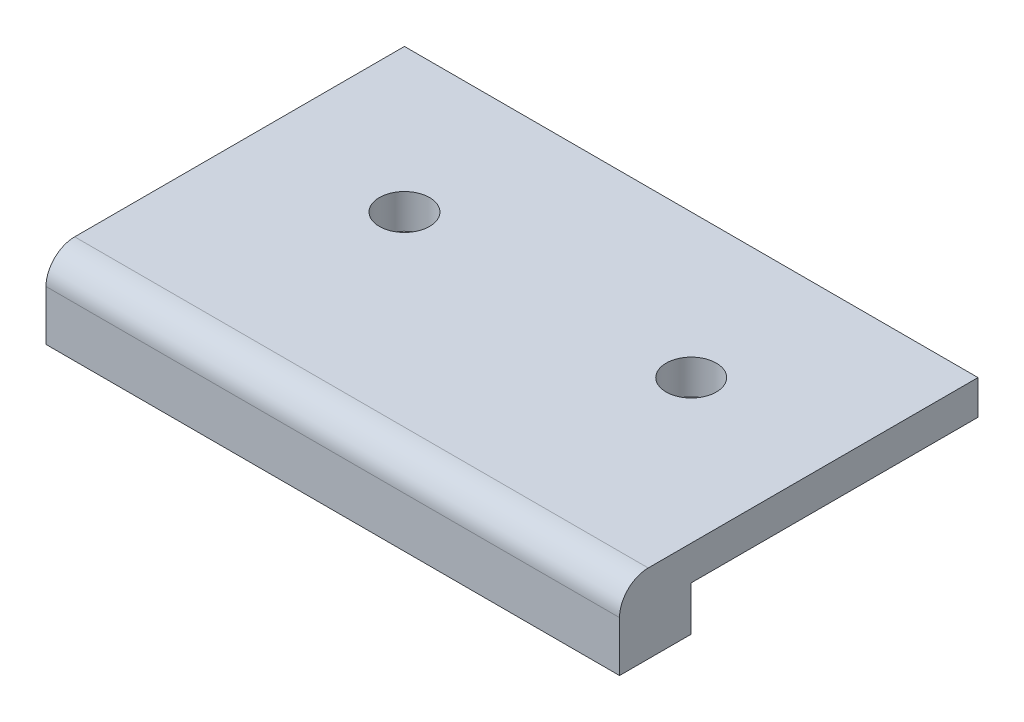
ISO-10303-21;
HEADER;
FILE_DESCRIPTION(('STEP AP214'),'2;1');
FILE_NAME('part.step','',(''),(''),'','','');
FILE_SCHEMA(('AUTOMOTIVE_DESIGN { 1 0 10303 214 1 1 1 1 }'));
ENDSEC;
DATA;
#1=APPLICATION_CONTEXT('core data for automotive mechanical design processes');
#2=APPLICATION_PROTOCOL_DEFINITION('international standard','automotive_design',2000,#1);
#3=PRODUCT_CONTEXT('',#1,'mechanical');
#4=PRODUCT('Part','Part','',(#3));
#5=PRODUCT_RELATED_PRODUCT_CATEGORY('part','',(#4));
#6=PRODUCT_DEFINITION_FORMATION('','',#4);
#7=PRODUCT_DEFINITION_CONTEXT('part definition',#1,'design');
#8=PRODUCT_DEFINITION('design','',#6,#7);
#9=PRODUCT_DEFINITION_SHAPE('','',#8);
#10=(LENGTH_UNIT() NAMED_UNIT(*) SI_UNIT(.MILLI.,.METRE.));
#11=(NAMED_UNIT(*) PLANE_ANGLE_UNIT() SI_UNIT($,.RADIAN.));
#12=(NAMED_UNIT(*) SI_UNIT($,.STERADIAN.) SOLID_ANGLE_UNIT());
#13=UNCERTAINTY_MEASURE_WITH_UNIT(LENGTH_MEASURE(1.E-05),#10,'distance_accuracy_value','');
#14=(GEOMETRIC_REPRESENTATION_CONTEXT(3) GLOBAL_UNCERTAINTY_ASSIGNED_CONTEXT((#13)) GLOBAL_UNIT_ASSIGNED_CONTEXT((#10,
#11,#12)) REPRESENTATION_CONTEXT('',''));
#15=CARTESIAN_POINT('',(0.,0.,0.));
#16=DIRECTION('',(0.,0.,1.));
#17=DIRECTION('',(1.,0.,0.));
#18=AXIS2_PLACEMENT_3D('',#15,#16,#17);
#19=CARTESIAN_POINT('',(0.,2.4,0.));
#20=DIRECTION('',(0.,-1.,0.));
#21=DIRECTION('',(0.,0.,-1.));
#22=AXIS2_PLACEMENT_3D('',#19,#20,#21);
#23=PLANE('',#22);
#24=DIRECTION('',(0.,0.,1.));
#25=VECTOR('',#24,1.);
#26=CARTESIAN_POINT('',(0.,2.4,0.));
#27=LINE('',#26,#25);
#28=CARTESIAN_POINT('',(0.,2.4,-20.));
#29=VERTEX_POINT('',#28);
#30=CARTESIAN_POINT('',(0.,2.4,3.));
#31=VERTEX_POINT('',#30);
#32=EDGE_CURVE('E134',#29,#31,#27,.T.);
#33=ORIENTED_EDGE('',*,*,#32,.T.);
#34=DIRECTION('',(1.,0.,0.));
#35=VECTOR('',#34,1.);
#36=CARTESIAN_POINT('',(40.,2.4,3.));
#37=LINE('',#36,#35);
#38=CARTESIAN_POINT('',(40.,2.4,3.));
#39=VERTEX_POINT('',#38);
#40=EDGE_CURVE('E154',#31,#39,#37,.T.);
#41=ORIENTED_EDGE('',*,*,#40,.T.);
#42=DIRECTION('',(0.,0.,-1.));
#43=VECTOR('',#42,1.);
#44=CARTESIAN_POINT('',(40.,2.4,0.));
#45=LINE('',#44,#43);
#46=CARTESIAN_POINT('',(40.,2.4,-20.));
#47=VERTEX_POINT('',#46);
#48=EDGE_CURVE('E137',#39,#47,#45,.T.);
#49=ORIENTED_EDGE('',*,*,#48,.T.);
#50=DIRECTION('',(-1.,0.,0.));
#51=VECTOR('',#50,1.);
#52=CARTESIAN_POINT('',(0.,2.4,-20.));
#53=LINE('',#52,#51);
#54=EDGE_CURVE('E140',#47,#29,#53,.T.);
#55=ORIENTED_EDGE('',*,*,#54,.T.);
#56=EDGE_LOOP('',(#33,#41,#49,#55));
#57=FACE_BOUND('',#56,.T.);
#58=CARTESIAN_POINT('',(10.,2.4,-10.));
#59=DIRECTION('',(0.,1.,0.));
#60=DIRECTION('',(0.,0.,1.));
#61=AXIS2_PLACEMENT_3D('',#58,#59,#60);
#62=CIRCLE('',#61,1.75);
#63=CARTESIAN_POINT('',(10.,2.4,-8.25));
#64=VERTEX_POINT('',#63);
#65=EDGE_CURVE('E128',#64,#64,#62,.T.);
#66=ORIENTED_EDGE('',*,*,#65,.F.);
#67=EDGE_LOOP('',(#66));
#68=FACE_BOUND('',#67,.T.);
#69=CARTESIAN_POINT('',(30.,2.4,-10.));
#70=DIRECTION('',(0.,1.,0.));
#71=DIRECTION('',(0.,0.,-1.));
#72=AXIS2_PLACEMENT_3D('',#69,#70,#71);
#73=CIRCLE('',#72,1.75);
#74=CARTESIAN_POINT('',(30.,2.4,-11.75));
#75=VERTEX_POINT('',#74);
#76=EDGE_CURVE('E122',#75,#75,#73,.T.);
#77=ORIENTED_EDGE('',*,*,#76,.F.);
#78=EDGE_LOOP('',(#77));
#79=FACE_BOUND('',#78,.T.);
#80=ADVANCED_FACE('F33',(#57,#68,#79),#23,.F.);
#81=CARTESIAN_POINT('',(0.,0.,0.));
#82=DIRECTION('',(0.,-1.,0.));
#83=DIRECTION('',(0.,0.,-1.));
#84=AXIS2_PLACEMENT_3D('',#81,#82,#83);
#85=PLANE('',#84);
#86=CARTESIAN_POINT('',(10.,0.,-10.));
#87=DIRECTION('',(0.,1.,0.));
#88=DIRECTION('',(0.,0.,1.));
#89=AXIS2_PLACEMENT_3D('',#86,#87,#88);
#90=CIRCLE('',#89,1.75);
#91=CARTESIAN_POINT('',(10.,0.,-8.25));
#92=VERTEX_POINT('',#91);
#93=EDGE_CURVE('E125',#92,#92,#90,.T.);
#94=ORIENTED_EDGE('',*,*,#93,.T.);
#95=EDGE_LOOP('',(#94));
#96=FACE_BOUND('',#95,.T.);
#97=DIRECTION('',(0.,0.,1.));
#98=VECTOR('',#97,1.);
#99=CARTESIAN_POINT('',(0.,0.,0.));
#100=LINE('',#99,#98);
#101=CARTESIAN_POINT('',(0.,0.,-20.));
#102=VERTEX_POINT('',#101);
#103=CARTESIAN_POINT('',(0.,0.,0.));
#104=VERTEX_POINT('',#103);
#105=EDGE_CURVE('E131',#102,#104,#100,.T.);
#106=ORIENTED_EDGE('',*,*,#105,.F.);
#107=DIRECTION('',(-1.,0.,0.));
#108=VECTOR('',#107,1.);
#109=CARTESIAN_POINT('',(0.,0.,-20.));
#110=LINE('',#109,#108);
#111=CARTESIAN_POINT('',(40.,0.,-20.));
#112=VERTEX_POINT('',#111);
#113=EDGE_CURVE('E138',#112,#102,#110,.T.);
#114=ORIENTED_EDGE('',*,*,#113,.F.);
#115=DIRECTION('',(0.,0.,-1.));
#116=VECTOR('',#115,1.);
#117=CARTESIAN_POINT('',(40.,0.,0.));
#118=LINE('',#117,#116);
#119=CARTESIAN_POINT('',(40.,0.,0.));
#120=VERTEX_POINT('',#119);
#121=EDGE_CURVE('E146',#120,#112,#118,.T.);
#122=ORIENTED_EDGE('',*,*,#121,.F.);
#123=DIRECTION('',(1.,0.,0.));
#124=VECTOR('',#123,1.);
#125=CARTESIAN_POINT('',(0.,0.,0.));
#126=LINE('',#125,#124);
#127=EDGE_CURVE('E96',#104,#120,#126,.T.);
#128=ORIENTED_EDGE('',*,*,#127,.F.);
#129=EDGE_LOOP('',(#106,#114,#122,#128));
#130=FACE_BOUND('',#129,.T.);
#131=CARTESIAN_POINT('',(30.,0.,-10.));
#132=DIRECTION('',(0.,1.,0.));
#133=DIRECTION('',(0.,0.,-1.));
#134=AXIS2_PLACEMENT_3D('',#131,#132,#133);
#135=CIRCLE('',#134,1.75);
#136=CARTESIAN_POINT('',(30.,0.,-11.75));
#137=VERTEX_POINT('',#136);
#138=EDGE_CURVE('E118',#137,#137,#135,.T.);
#139=ORIENTED_EDGE('',*,*,#138,.T.);
#140=EDGE_LOOP('',(#139));
#141=FACE_BOUND('',#140,.T.);
#142=ADVANCED_FACE('F178',(#96,#130,#141),#85,.T.);
#143=CARTESIAN_POINT('',(0.,2.4,0.));
#144=DIRECTION('',(1.,0.,0.));
#145=DIRECTION('',(0.,0.,-1.));
#146=AXIS2_PLACEMENT_3D('',#143,#144,#145);
#147=PLANE('',#146);
#148=DIRECTION('',(0.,1.,0.));
#149=VECTOR('',#148,1.);
#150=CARTESIAN_POINT('',(0.,-3.1,5.));
#151=LINE('',#150,#149);
#152=CARTESIAN_POINT('',(0.,-3.1,5.));
#153=VERTEX_POINT('',#152);
#154=CARTESIAN_POINT('',(0.,0.4,5.));
#155=VERTEX_POINT('',#154);
#156=EDGE_CURVE('E119',#153,#155,#151,.T.);
#157=ORIENTED_EDGE('',*,*,#156,.T.);
#158=CARTESIAN_POINT('',(0.,0.4,3.));
#159=DIRECTION('',(1.,0.,0.));
#160=DIRECTION('',(0.,0.,-1.));
#161=AXIS2_PLACEMENT_3D('',#158,#159,#160);
#162=CIRCLE('',#161,2.);
#163=EDGE_CURVE('E11',#155,#31,#162,.F.);
#164=ORIENTED_EDGE('',*,*,#163,.T.);
#165=ORIENTED_EDGE('',*,*,#32,.F.);
#166=DIRECTION('',(0.,-1.,0.));
#167=VECTOR('',#166,1.);
#168=CARTESIAN_POINT('',(0.,2.4,-20.));
#169=LINE('',#168,#167);
#170=EDGE_CURVE('E142',#29,#102,#169,.T.);
#171=ORIENTED_EDGE('',*,*,#170,.T.);
#172=ORIENTED_EDGE('',*,*,#105,.T.);
#173=DIRECTION('',(0.,1.,0.));
#174=VECTOR('',#173,1.);
#175=CARTESIAN_POINT('',(0.,-3.1,0.));
#176=LINE('',#175,#174);
#177=CARTESIAN_POINT('',(0.,-3.1,0.));
#178=VERTEX_POINT('',#177);
#179=EDGE_CURVE('E98',#178,#104,#176,.T.);
#180=ORIENTED_EDGE('',*,*,#179,.F.);
#181=DIRECTION('',(0.,0.,1.));
#182=VECTOR('',#181,1.);
#183=CARTESIAN_POINT('',(0.,-3.1,0.));
#184=LINE('',#183,#182);
#185=EDGE_CURVE('E109',#178,#153,#184,.T.);
#186=ORIENTED_EDGE('',*,*,#185,.T.);
#187=EDGE_LOOP('',(#157,#164,#165,#171,#172,#180,#186));
#188=FACE_BOUND('',#187,.T.);
#189=ADVANCED_FACE('F171',(#188),#147,.F.);
#190=CARTESIAN_POINT('',(40.,2.4,0.));
#191=DIRECTION('',(-1.,0.,0.));
#192=DIRECTION('',(0.,0.,1.));
#193=AXIS2_PLACEMENT_3D('',#190,#191,#192);
#194=PLANE('',#193);
#195=ORIENTED_EDGE('',*,*,#48,.F.);
#196=CARTESIAN_POINT('',(40.,0.4,3.));
#197=DIRECTION('',(-1.,0.,0.));
#198=DIRECTION('',(0.,0.,1.));
#199=AXIS2_PLACEMENT_3D('',#196,#197,#198);
#200=CIRCLE('',#199,2.);
#201=CARTESIAN_POINT('',(40.,0.4,5.));
#202=VERTEX_POINT('',#201);
#203=EDGE_CURVE('E55',#39,#202,#200,.F.);
#204=ORIENTED_EDGE('',*,*,#203,.T.);
#205=DIRECTION('',(0.,1.,0.));
#206=VECTOR('',#205,1.);
#207=CARTESIAN_POINT('',(40.,-3.1,5.));
#208=LINE('',#207,#206);
#209=CARTESIAN_POINT('',(40.,-3.1,5.));
#210=VERTEX_POINT('',#209);
#211=EDGE_CURVE('E112',#210,#202,#208,.T.);
#212=ORIENTED_EDGE('',*,*,#211,.F.);
#213=DIRECTION('',(0.,0.,-1.));
#214=VECTOR('',#213,1.);
#215=CARTESIAN_POINT('',(40.,-3.1,0.));
#216=LINE('',#215,#214);
#217=CARTESIAN_POINT('',(40.,-3.1,0.));
#218=VERTEX_POINT('',#217);
#219=EDGE_CURVE('E106',#210,#218,#216,.T.);
#220=ORIENTED_EDGE('',*,*,#219,.T.);
#221=DIRECTION('',(0.,1.,0.));
#222=VECTOR('',#221,1.);
#223=CARTESIAN_POINT('',(40.,-3.1,0.));
#224=LINE('',#223,#222);
#225=EDGE_CURVE('E91',#218,#120,#224,.T.);
#226=ORIENTED_EDGE('',*,*,#225,.T.);
#227=ORIENTED_EDGE('',*,*,#121,.T.);
#228=DIRECTION('',(0.,-1.,0.));
#229=VECTOR('',#228,1.);
#230=CARTESIAN_POINT('',(40.,2.4,-20.));
#231=LINE('',#230,#229);
#232=EDGE_CURVE('E151',#47,#112,#231,.T.);
#233=ORIENTED_EDGE('',*,*,#232,.F.);
#234=EDGE_LOOP('',(#195,#204,#212,#220,#226,#227,#233));
#235=FACE_BOUND('',#234,.T.);
#236=ADVANCED_FACE('F111',(#235),#194,.F.);
#237=CARTESIAN_POINT('',(0.,2.4,-20.));
#238=DIRECTION('',(0.,0.,1.));
#239=DIRECTION('',(1.,0.,0.));
#240=AXIS2_PLACEMENT_3D('',#237,#238,#239);
#241=PLANE('',#240);
#242=ORIENTED_EDGE('',*,*,#113,.T.);
#243=ORIENTED_EDGE('',*,*,#170,.F.);
#244=ORIENTED_EDGE('',*,*,#54,.F.);
#245=ORIENTED_EDGE('',*,*,#232,.T.);
#246=EDGE_LOOP('',(#242,#243,#244,#245));
#247=FACE_BOUND('',#246,.T.);
#248=ADVANCED_FACE('F168',(#247),#241,.F.);
#249=CARTESIAN_POINT('',(10.,2.4,-10.));
#250=DIRECTION('',(0.,-1.,0.));
#251=DIRECTION('',(0.,0.,-1.));
#252=AXIS2_PLACEMENT_3D('',#249,#250,#251);
#253=CYLINDRICAL_SURFACE('',#252,1.75);
#254=ORIENTED_EDGE('',*,*,#65,.T.);
#255=EDGE_LOOP('',(#254));
#256=FACE_BOUND('',#255,.T.);
#257=ORIENTED_EDGE('',*,*,#93,.F.);
#258=EDGE_LOOP('',(#257));
#259=FACE_BOUND('',#258,.T.);
#260=ADVANCED_FACE('F186',(#256,#259),#253,.F.);
#261=CARTESIAN_POINT('',(30.,2.4,-10.));
#262=DIRECTION('',(0.,-1.,0.));
#263=DIRECTION('',(0.,0.,-1.));
#264=AXIS2_PLACEMENT_3D('',#261,#262,#263);
#265=CYLINDRICAL_SURFACE('',#264,1.75);
#266=ORIENTED_EDGE('',*,*,#76,.T.);
#267=EDGE_LOOP('',(#266));
#268=FACE_BOUND('',#267,.T.);
#269=ORIENTED_EDGE('',*,*,#138,.F.);
#270=EDGE_LOOP('',(#269));
#271=FACE_BOUND('',#270,.T.);
#272=ADVANCED_FACE('F212',(#268,#271),#265,.F.);
#273=CARTESIAN_POINT('',(0.,-3.1,5.));
#274=DIRECTION('',(0.,0.,1.));
#275=DIRECTION('',(1.,0.,0.));
#276=AXIS2_PLACEMENT_3D('',#273,#274,#275);
#277=PLANE('',#276);
#278=ORIENTED_EDGE('',*,*,#211,.T.);
#279=DIRECTION('',(1.,0.,0.));
#280=VECTOR('',#279,1.);
#281=CARTESIAN_POINT('',(0.,0.4,5.));
#282=LINE('',#281,#280);
#283=EDGE_CURVE('E41',#202,#155,#282,.F.);
#284=ORIENTED_EDGE('',*,*,#283,.T.);
#285=ORIENTED_EDGE('',*,*,#156,.F.);
#286=DIRECTION('',(1.,0.,0.));
#287=VECTOR('',#286,1.);
#288=CARTESIAN_POINT('',(0.,-3.1,5.));
#289=LINE('',#288,#287);
#290=EDGE_CURVE('E99',#153,#210,#289,.T.);
#291=ORIENTED_EDGE('',*,*,#290,.T.);
#292=EDGE_LOOP('',(#278,#284,#285,#291));
#293=FACE_BOUND('',#292,.T.);
#294=ADVANCED_FACE('F219',(#293),#277,.T.);
#295=CARTESIAN_POINT('',(0.,-3.1,0.));
#296=DIRECTION('',(0.,0.,-1.));
#297=DIRECTION('',(-1.,0.,0.));
#298=AXIS2_PLACEMENT_3D('',#295,#296,#297);
#299=PLANE('',#298);
#300=ORIENTED_EDGE('',*,*,#179,.T.);
#301=ORIENTED_EDGE('',*,*,#127,.T.);
#302=ORIENTED_EDGE('',*,*,#225,.F.);
#303=DIRECTION('',(-1.,0.,0.));
#304=VECTOR('',#303,1.);
#305=CARTESIAN_POINT('',(0.,-3.1,0.));
#306=LINE('',#305,#304);
#307=EDGE_CURVE('E95',#218,#178,#306,.T.);
#308=ORIENTED_EDGE('',*,*,#307,.T.);
#309=EDGE_LOOP('',(#300,#301,#302,#308));
#310=FACE_BOUND('',#309,.T.);
#311=ADVANCED_FACE('F94',(#310),#299,.T.);
#312=CARTESIAN_POINT('',(0.,-3.1,0.));
#313=DIRECTION('',(0.,1.,0.));
#314=DIRECTION('',(0.,0.,1.));
#315=AXIS2_PLACEMENT_3D('',#312,#313,#314);
#316=PLANE('',#315);
#317=ORIENTED_EDGE('',*,*,#219,.F.);
#318=ORIENTED_EDGE('',*,*,#290,.F.);
#319=ORIENTED_EDGE('',*,*,#185,.F.);
#320=ORIENTED_EDGE('',*,*,#307,.F.);
#321=EDGE_LOOP('',(#317,#318,#319,#320));
#322=FACE_BOUND('',#321,.T.);
#323=ADVANCED_FACE('F104',(#322),#316,.F.);
#324=CARTESIAN_POINT('',(0.,0.4,3.));
#325=DIRECTION('',(-1.,0.,0.));
#326=DIRECTION('',(0.,0.,1.));
#327=AXIS2_PLACEMENT_3D('',#324,#325,#326);
#328=CYLINDRICAL_SURFACE('',#327,2.);
#329=ORIENTED_EDGE('',*,*,#163,.F.);
#330=ORIENTED_EDGE('',*,*,#283,.F.);
#331=ORIENTED_EDGE('',*,*,#203,.F.);
#332=ORIENTED_EDGE('',*,*,#40,.F.);
#333=EDGE_LOOP('',(#329,#330,#331,#332));
#334=FACE_BOUND('',#333,.T.);
#335=ADVANCED_FACE('F35',(#334),#328,.T.);
#336=CLOSED_SHELL('',(#80,#142,#189,#236,#248,#260,#272,#294,#311,#323,#335));
#337=MANIFOLD_SOLID_BREP('B2',#336);
#338=ADVANCED_BREP_SHAPE_REPRESENTATION('',(#18,#337),#14);
#339=SHAPE_DEFINITION_REPRESENTATION(#9,#338);
ENDSEC;
END-ISO-10303-21;
